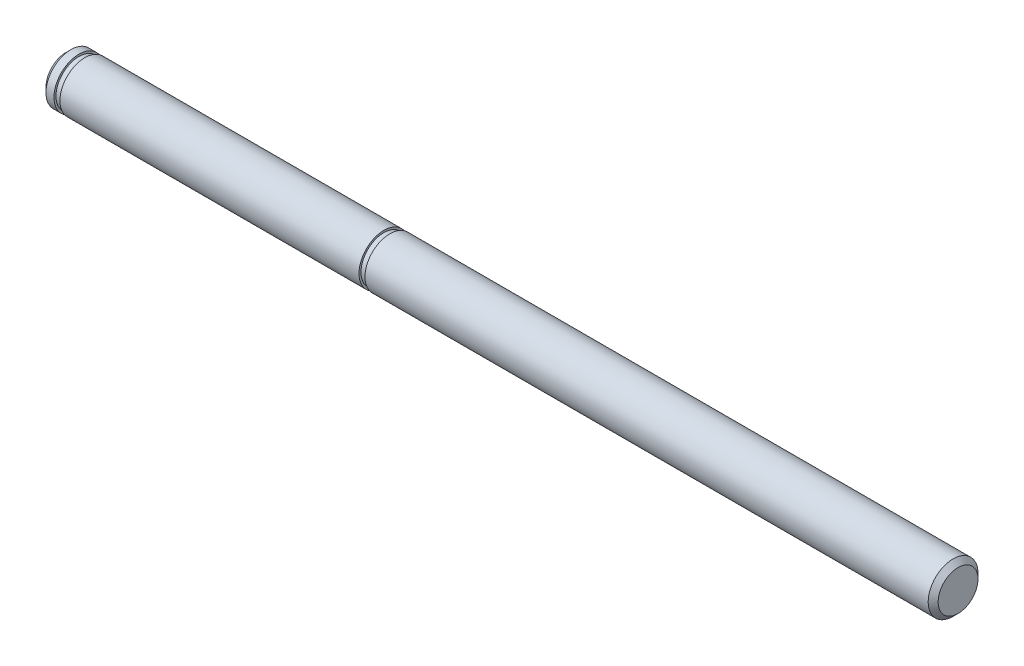
ISO-10303-21;
HEADER;
FILE_DESCRIPTION(('STEP AP214'),'2;1');
FILE_NAME('part.step','',(''),(''),'','','');
FILE_SCHEMA(('AUTOMOTIVE_DESIGN { 1 0 10303 214 1 1 1 1 }'));
ENDSEC;
DATA;
#1=APPLICATION_CONTEXT('core data for automotive mechanical design processes');
#2=APPLICATION_PROTOCOL_DEFINITION('international standard','automotive_design',2000,#1);
#3=PRODUCT_CONTEXT('',#1,'mechanical');
#4=PRODUCT('Part','Part','',(#3));
#5=PRODUCT_RELATED_PRODUCT_CATEGORY('part','',(#4));
#6=PRODUCT_DEFINITION_FORMATION('','',#4);
#7=PRODUCT_DEFINITION_CONTEXT('part definition',#1,'design');
#8=PRODUCT_DEFINITION('design','',#6,#7);
#9=PRODUCT_DEFINITION_SHAPE('','',#8);
#10=(LENGTH_UNIT() NAMED_UNIT(*) SI_UNIT(.MILLI.,.METRE.));
#11=(NAMED_UNIT(*) PLANE_ANGLE_UNIT() SI_UNIT($,.RADIAN.));
#12=(NAMED_UNIT(*) SI_UNIT($,.STERADIAN.) SOLID_ANGLE_UNIT());
#13=UNCERTAINTY_MEASURE_WITH_UNIT(LENGTH_MEASURE(1.E-05),#10,'distance_accuracy_value','');
#14=(GEOMETRIC_REPRESENTATION_CONTEXT(3) GLOBAL_UNCERTAINTY_ASSIGNED_CONTEXT((#13)) GLOBAL_UNIT_ASSIGNED_CONTEXT((#10,
#11,#12)) REPRESENTATION_CONTEXT('',''));
#15=CARTESIAN_POINT('',(0.,0.,0.));
#16=DIRECTION('',(0.,0.,1.));
#17=DIRECTION('',(1.,0.,0.));
#18=AXIS2_PLACEMENT_3D('',#15,#16,#17);
#19=CARTESIAN_POINT('',(113.665,0.,0.));
#20=DIRECTION('',(-1.,0.,0.));
#21=DIRECTION('',(0.,0.,1.));
#22=AXIS2_PLACEMENT_3D('',#19,#20,#21);
#23=CYLINDRICAL_SURFACE('',#22,3.175);
#24=CARTESIAN_POINT('',(0.635000000000011,0.,0.));
#25=DIRECTION('',(1.,0.,0.));
#26=DIRECTION('',(0.,0.,-1.));
#27=AXIS2_PLACEMENT_3D('',#24,#25,#26);
#28=CIRCLE('',#27,3.175);
#29=CARTESIAN_POINT('',(0.635000000000011,0.,-3.175));
#30=VERTEX_POINT('',#29);
#31=EDGE_CURVE('E55',#30,#30,#28,.T.);
#32=ORIENTED_EDGE('',*,*,#31,.T.);
#33=EDGE_LOOP('',(#32));
#34=FACE_BOUND('',#33,.T.);
#35=CARTESIAN_POINT('',(1.651,0.,0.));
#36=DIRECTION('',(-1.,0.,0.));
#37=DIRECTION('',(0.,0.,1.));
#38=AXIS2_PLACEMENT_3D('',#35,#36,#37);
#39=CIRCLE('',#38,3.175);
#40=CARTESIAN_POINT('',(1.651,0.,3.175));
#41=VERTEX_POINT('',#40);
#42=EDGE_CURVE('E83',#41,#41,#39,.T.);
#43=ORIENTED_EDGE('',*,*,#42,.T.);
#44=EDGE_LOOP('',(#43));
#45=FACE_BOUND('',#44,.T.);
#46=ADVANCED_FACE('F43',(#34,#45),#23,.T.);
#47=CARTESIAN_POINT('',(0.,0.,0.));
#48=DIRECTION('',(1.,0.,0.));
#49=DIRECTION('',(0.,0.,-1.));
#50=AXIS2_PLACEMENT_3D('',#47,#48,#49);
#51=PLANE('',#50);
#52=CARTESIAN_POINT('',(0.,0.,0.));
#53=DIRECTION('',(1.,0.,0.));
#54=DIRECTION('',(0.,0.,-1.));
#55=AXIS2_PLACEMENT_3D('',#52,#53,#54);
#56=CIRCLE('',#55,2.53999999999999);
#57=CARTESIAN_POINT('',(0.,0.,-2.53999999999999));
#58=VERTEX_POINT('',#57);
#59=EDGE_CURVE('E10',#58,#58,#56,.F.);
#60=ORIENTED_EDGE('',*,*,#59,.T.);
#61=EDGE_LOOP('',(#60));
#62=FACE_BOUND('',#61,.T.);
#63=ADVANCED_FACE('F111',(#62),#51,.F.);
#64=CARTESIAN_POINT('',(0.635000000000011,0.,0.));
#65=DIRECTION('',(1.,0.,0.));
#66=DIRECTION('',(0.,0.,-1.));
#67=AXIS2_PLACEMENT_3D('',#64,#65,#66);
#68=CONICAL_SURFACE('',#67,3.175,0.78539816339745);
#69=ORIENTED_EDGE('',*,*,#59,.F.);
#70=EDGE_LOOP('',(#69));
#71=FACE_BOUND('',#70,.T.);
#72=ORIENTED_EDGE('',*,*,#31,.F.);
#73=EDGE_LOOP('',(#72));
#74=FACE_BOUND('',#73,.T.);
#75=ADVANCED_FACE('F46',(#71,#74),#68,.T.);
#76=CARTESIAN_POINT('',(2.413,2.921,0.));
#77=DIRECTION('',(-1.,0.,0.));
#78=DIRECTION('',(0.,0.,1.));
#79=AXIS2_PLACEMENT_3D('',#76,#77,#78);
#80=PLANE('',#79);
#81=CARTESIAN_POINT('',(2.413,0.,0.));
#82=DIRECTION('',(-1.,0.,0.));
#83=DIRECTION('',(0.,0.,1.));
#84=AXIS2_PLACEMENT_3D('',#81,#82,#83);
#85=CIRCLE('',#84,3.175);
#86=CARTESIAN_POINT('',(2.413,0.,3.175));
#87=VERTEX_POINT('',#86);
#88=EDGE_CURVE('E68',#87,#87,#85,.T.);
#89=ORIENTED_EDGE('',*,*,#88,.T.);
#90=EDGE_LOOP('',(#89));
#91=FACE_BOUND('',#90,.T.);
#92=CARTESIAN_POINT('',(2.413,0.,0.));
#93=DIRECTION('',(-1.,0.,0.));
#94=DIRECTION('',(0.,0.,1.));
#95=AXIS2_PLACEMENT_3D('',#92,#93,#94);
#96=CIRCLE('',#95,2.921);
#97=CARTESIAN_POINT('',(2.413,0.,2.921));
#98=VERTEX_POINT('',#97);
#99=EDGE_CURVE('E64',#98,#98,#96,.T.);
#100=ORIENTED_EDGE('',*,*,#99,.F.);
#101=EDGE_LOOP('',(#100));
#102=FACE_BOUND('',#101,.T.);
#103=ADVANCED_FACE('F89',(#91,#102),#80,.T.);
#104=CARTESIAN_POINT('',(0.,0.,0.));
#105=DIRECTION('',(-1.,0.,0.));
#106=DIRECTION('',(0.,0.,1.));
#107=AXIS2_PLACEMENT_3D('',#104,#105,#106);
#108=CYLINDRICAL_SURFACE('',#107,2.921);
#109=ORIENTED_EDGE('',*,*,#99,.T.);
#110=EDGE_LOOP('',(#109));
#111=FACE_BOUND('',#110,.T.);
#112=CARTESIAN_POINT('',(1.651,0.,0.));
#113=DIRECTION('',(-1.,0.,0.));
#114=DIRECTION('',(0.,0.,1.));
#115=AXIS2_PLACEMENT_3D('',#112,#113,#114);
#116=CIRCLE('',#115,2.921);
#117=CARTESIAN_POINT('',(1.651,0.,2.921));
#118=VERTEX_POINT('',#117);
#119=EDGE_CURVE('E80',#118,#118,#116,.T.);
#120=ORIENTED_EDGE('',*,*,#119,.F.);
#121=EDGE_LOOP('',(#120));
#122=FACE_BOUND('',#121,.T.);
#123=ADVANCED_FACE('F106',(#111,#122),#108,.T.);
#124=CARTESIAN_POINT('',(1.651,2.921,0.));
#125=DIRECTION('',(1.,0.,0.));
#126=DIRECTION('',(0.,0.,-1.));
#127=AXIS2_PLACEMENT_3D('',#124,#125,#126);
#128=PLANE('',#127);
#129=ORIENTED_EDGE('',*,*,#119,.T.);
#130=EDGE_LOOP('',(#129));
#131=FACE_BOUND('',#130,.T.);
#132=ORIENTED_EDGE('',*,*,#42,.F.);
#133=EDGE_LOOP('',(#132));
#134=FACE_BOUND('',#133,.T.);
#135=ADVANCED_FACE('F95',(#131,#134),#128,.T.);
#136=CARTESIAN_POINT('',(40.513,0.,0.));
#137=DIRECTION('',(-1.,0.,0.));
#138=DIRECTION('',(0.,0.,1.));
#139=AXIS2_PLACEMENT_3D('',#136,#137,#138);
#140=CIRCLE('',#139,3.175);
#141=CARTESIAN_POINT('',(40.513,0.,3.175));
#142=VERTEX_POINT('',#141);
#143=EDGE_CURVE('E75',#142,#142,#140,.T.);
#144=ORIENTED_EDGE('',*,*,#143,.T.);
#145=EDGE_LOOP('',(#144));
#146=FACE_BOUND('',#145,.T.);
#147=ORIENTED_EDGE('',*,*,#88,.F.);
#148=EDGE_LOOP('',(#147));
#149=FACE_BOUND('',#148,.T.);
#150=ADVANCED_FACE('F92',(#146,#149),#23,.T.);
#151=CARTESIAN_POINT('',(41.275,2.921,0.));
#152=DIRECTION('',(-1.,0.,0.));
#153=DIRECTION('',(0.,0.,1.));
#154=AXIS2_PLACEMENT_3D('',#151,#152,#153);
#155=PLANE('',#154);
#156=CARTESIAN_POINT('',(41.275,0.,0.));
#157=DIRECTION('',(-1.,0.,0.));
#158=DIRECTION('',(0.,0.,1.));
#159=AXIS2_PLACEMENT_3D('',#156,#157,#158);
#160=CIRCLE('',#159,3.175);
#161=CARTESIAN_POINT('',(41.275,0.,3.175));
#162=VERTEX_POINT('',#161);
#163=EDGE_CURVE('E65',#162,#162,#160,.T.);
#164=ORIENTED_EDGE('',*,*,#163,.T.);
#165=EDGE_LOOP('',(#164));
#166=FACE_BOUND('',#165,.T.);
#167=CARTESIAN_POINT('',(41.275,0.,0.));
#168=DIRECTION('',(-1.,0.,0.));
#169=DIRECTION('',(0.,0.,1.));
#170=AXIS2_PLACEMENT_3D('',#167,#168,#169);
#171=CIRCLE('',#170,2.921);
#172=CARTESIAN_POINT('',(41.275,0.,2.921));
#173=VERTEX_POINT('',#172);
#174=EDGE_CURVE('E69',#173,#173,#171,.T.);
#175=ORIENTED_EDGE('',*,*,#174,.F.);
#176=EDGE_LOOP('',(#175));
#177=FACE_BOUND('',#176,.T.);
#178=ADVANCED_FACE('F94',(#166,#177),#155,.T.);
#179=CARTESIAN_POINT('',(0.,0.,0.));
#180=DIRECTION('',(-1.,0.,0.));
#181=DIRECTION('',(0.,0.,1.));
#182=AXIS2_PLACEMENT_3D('',#179,#180,#181);
#183=CYLINDRICAL_SURFACE('',#182,2.921);
#184=ORIENTED_EDGE('',*,*,#174,.T.);
#185=EDGE_LOOP('',(#184));
#186=FACE_BOUND('',#185,.T.);
#187=CARTESIAN_POINT('',(40.513,0.,0.));
#188=DIRECTION('',(-1.,0.,0.));
#189=DIRECTION('',(0.,0.,1.));
#190=AXIS2_PLACEMENT_3D('',#187,#188,#189);
#191=CIRCLE('',#190,2.921);
#192=CARTESIAN_POINT('',(40.513,0.,2.921));
#193=VERTEX_POINT('',#192);
#194=EDGE_CURVE('E72',#193,#193,#191,.T.);
#195=ORIENTED_EDGE('',*,*,#194,.F.);
#196=EDGE_LOOP('',(#195));
#197=FACE_BOUND('',#196,.T.);
#198=ADVANCED_FACE('F103',(#186,#197),#183,.T.);
#199=CARTESIAN_POINT('',(40.513,2.921,0.));
#200=DIRECTION('',(1.,0.,0.));
#201=DIRECTION('',(0.,0.,-1.));
#202=AXIS2_PLACEMENT_3D('',#199,#200,#201);
#203=PLANE('',#202);
#204=ORIENTED_EDGE('',*,*,#194,.T.);
#205=EDGE_LOOP('',(#204));
#206=FACE_BOUND('',#205,.T.);
#207=ORIENTED_EDGE('',*,*,#143,.F.);
#208=EDGE_LOOP('',(#207));
#209=FACE_BOUND('',#208,.T.);
#210=ADVANCED_FACE('F128',(#206,#209),#203,.T.);
#211=CARTESIAN_POINT('',(113.665,0.,0.));
#212=DIRECTION('',(1.,0.,0.));
#213=DIRECTION('',(0.,0.,-1.));
#214=AXIS2_PLACEMENT_3D('',#211,#212,#213);
#215=PLANE('',#214);
#216=CARTESIAN_POINT('',(113.665,0.,0.));
#217=DIRECTION('',(1.,0.,0.));
#218=DIRECTION('',(0.,0.,-1.));
#219=AXIS2_PLACEMENT_3D('',#216,#217,#218);
#220=CIRCLE('',#219,2.54);
#221=CARTESIAN_POINT('',(113.665,0.,-2.54));
#222=VERTEX_POINT('',#221);
#223=EDGE_CURVE('E59',#222,#222,#220,.T.);
#224=ORIENTED_EDGE('',*,*,#223,.T.);
#225=EDGE_LOOP('',(#224));
#226=FACE_BOUND('',#225,.T.);
#227=ADVANCED_FACE('F119',(#226),#215,.T.);
#228=CARTESIAN_POINT('',(113.665,0.,0.));
#229=DIRECTION('',(-1.,0.,0.));
#230=DIRECTION('',(0.,0.,1.));
#231=AXIS2_PLACEMENT_3D('',#228,#229,#230);
#232=CONICAL_SURFACE('',#231,2.54,0.78539816339745);
#233=CARTESIAN_POINT('',(113.03,0.,0.));
#234=DIRECTION('',(1.,0.,0.));
#235=DIRECTION('',(0.,0.,-1.));
#236=AXIS2_PLACEMENT_3D('',#233,#234,#235);
#237=CIRCLE('',#236,3.175);
#238=CARTESIAN_POINT('',(113.03,0.,-3.175));
#239=VERTEX_POINT('',#238);
#240=EDGE_CURVE('E51',#239,#239,#237,.F.);
#241=ORIENTED_EDGE('',*,*,#240,.F.);
#242=EDGE_LOOP('',(#241));
#243=FACE_BOUND('',#242,.T.);
#244=ORIENTED_EDGE('',*,*,#223,.F.);
#245=EDGE_LOOP('',(#244));
#246=FACE_BOUND('',#245,.T.);
#247=ADVANCED_FACE('F114',(#243,#246),#232,.T.);
#248=ORIENTED_EDGE('',*,*,#240,.T.);
#249=EDGE_LOOP('',(#248));
#250=FACE_BOUND('',#249,.T.);
#251=ORIENTED_EDGE('',*,*,#163,.F.);
#252=EDGE_LOOP('',(#251));
#253=FACE_BOUND('',#252,.T.);
#254=ADVANCED_FACE('F98',(#250,#253),#23,.T.);
#255=CLOSED_SHELL('',(#46,#63,#75,#103,#123,#135,#150,#178,#198,#210,#227,#247,#254));
#256=MANIFOLD_SOLID_BREP('B2',#255);
#257=ADVANCED_BREP_SHAPE_REPRESENTATION('',(#18,#256),#14);
#258=SHAPE_DEFINITION_REPRESENTATION(#9,#257);
ENDSEC;
END-ISO-10303-21;
